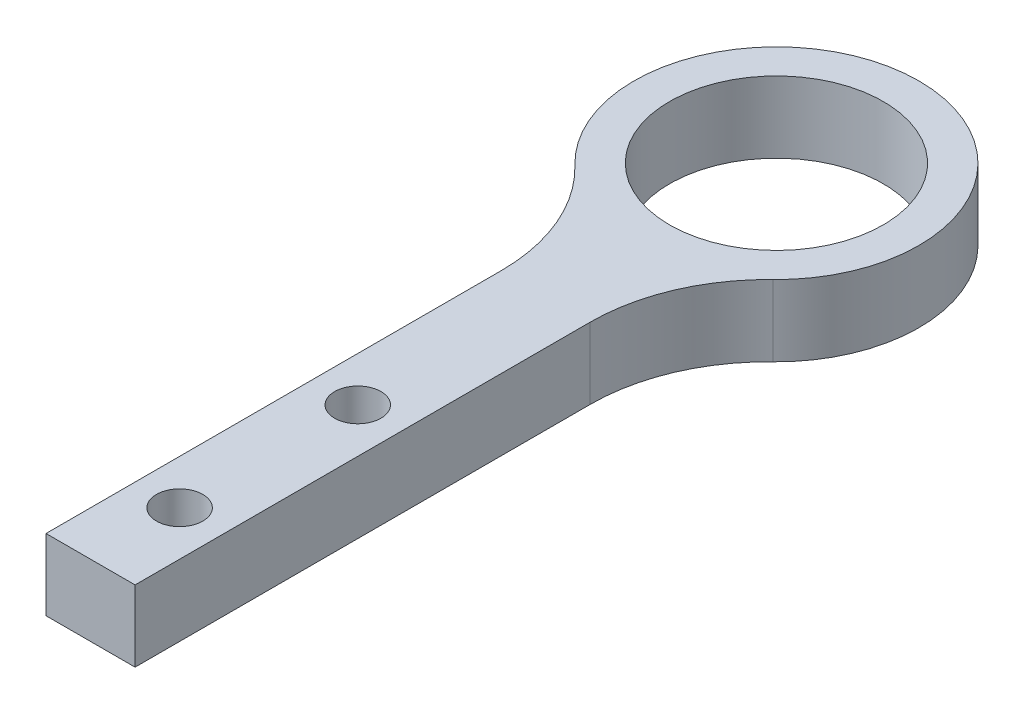
ISO-10303-21;
HEADER;
FILE_DESCRIPTION(('STEP AP214'),'2;1');
FILE_NAME('part.step','',(''),(''),'','','');
FILE_SCHEMA(('AUTOMOTIVE_DESIGN { 1 0 10303 214 1 1 1 1 }'));
ENDSEC;
DATA;
#1=APPLICATION_CONTEXT('core data for automotive mechanical design processes');
#2=APPLICATION_PROTOCOL_DEFINITION('international standard','automotive_design',2000,#1);
#3=PRODUCT_CONTEXT('',#1,'mechanical');
#4=PRODUCT('Part','Part','',(#3));
#5=PRODUCT_RELATED_PRODUCT_CATEGORY('part','',(#4));
#6=PRODUCT_DEFINITION_FORMATION('','',#4);
#7=PRODUCT_DEFINITION_CONTEXT('part definition',#1,'design');
#8=PRODUCT_DEFINITION('design','',#6,#7);
#9=PRODUCT_DEFINITION_SHAPE('','',#8);
#10=(LENGTH_UNIT() NAMED_UNIT(*) SI_UNIT(.MILLI.,.METRE.));
#11=(NAMED_UNIT(*) PLANE_ANGLE_UNIT() SI_UNIT($,.RADIAN.));
#12=(NAMED_UNIT(*) SI_UNIT($,.STERADIAN.) SOLID_ANGLE_UNIT());
#13=UNCERTAINTY_MEASURE_WITH_UNIT(LENGTH_MEASURE(1.E-05),#10,'distance_accuracy_value','');
#14=(GEOMETRIC_REPRESENTATION_CONTEXT(3) GLOBAL_UNCERTAINTY_ASSIGNED_CONTEXT((#13)) GLOBAL_UNIT_ASSIGNED_CONTEXT((#10,
#11,#12)) REPRESENTATION_CONTEXT('',''));
#15=CARTESIAN_POINT('',(0.,0.,0.));
#16=DIRECTION('',(0.,0.,1.));
#17=DIRECTION('',(1.,0.,0.));
#18=AXIS2_PLACEMENT_3D('',#15,#16,#17);
#19=CARTESIAN_POINT('',(-12.5,4.,12.9518338469886));
#20=DIRECTION('',(0.,-1.,0.));
#21=DIRECTION('',(0.,0.,-1.));
#22=AXIS2_PLACEMENT_3D('',#19,#20,#21);
#23=PLANE('',#22);
#24=CARTESIAN_POINT('',(0.,4.,23.5));
#25=DIRECTION('',(0.,-1.,0.));
#26=DIRECTION('',(0.,0.,-1.));
#27=AXIS2_PLACEMENT_3D('',#24,#25,#26);
#28=CIRCLE('',#27,1.3);
#29=CARTESIAN_POINT('',(0.,4.,22.2));
#30=VERTEX_POINT('',#29);
#31=EDGE_CURVE('E191',#30,#30,#28,.T.);
#32=ORIENTED_EDGE('',*,*,#31,.T.);
#33=EDGE_LOOP('',(#32));
#34=FACE_BOUND('',#33,.T.);
#35=CARTESIAN_POINT('',(0.,4.,33.5));
#36=DIRECTION('',(0.,-1.,0.));
#37=DIRECTION('',(0.,0.,-1.));
#38=AXIS2_PLACEMENT_3D('',#35,#36,#37);
#39=CIRCLE('',#38,1.3);
#40=CARTESIAN_POINT('',(0.,4.,32.2));
#41=VERTEX_POINT('',#40);
#42=EDGE_CURVE('E201',#41,#41,#39,.T.);
#43=ORIENTED_EDGE('',*,*,#42,.T.);
#44=EDGE_LOOP('',(#43));
#45=FACE_BOUND('',#44,.T.);
#46=DIRECTION('',(0.,0.,-1.));
#47=VECTOR('',#46,1.);
#48=CARTESIAN_POINT('',(2.5,4.,12.9518338469886));
#49=LINE('',#48,#47);
#50=CARTESIAN_POINT('',(2.5,4.,38.5));
#51=VERTEX_POINT('',#50);
#52=CARTESIAN_POINT('',(2.5,4.,12.9518338469886));
#53=VERTEX_POINT('',#52);
#54=EDGE_CURVE('E130',#51,#53,#49,.T.);
#55=ORIENTED_EDGE('',*,*,#54,.T.);
#56=CARTESIAN_POINT('',(12.5,4.,12.9518338469886));
#57=DIRECTION('',(0.,-1.,0.));
#58=DIRECTION('',(0.,0.,1.));
#59=AXIS2_PLACEMENT_3D('',#56,#57,#58);
#60=CIRCLE('',#59,10.);
#61=CARTESIAN_POINT('',(5.55555555555555,4.,5.75637059866161));
#62=VERTEX_POINT('',#61);
#63=EDGE_CURVE('E88',#53,#62,#60,.T.);
#64=ORIENTED_EDGE('',*,*,#63,.T.);
#65=CARTESIAN_POINT('',(0.,4.,0.));
#66=DIRECTION('',(0.,1.,0.));
#67=DIRECTION('',(0.,0.,1.));
#68=AXIS2_PLACEMENT_3D('',#65,#66,#67);
#69=CIRCLE('',#68,8.);
#70=CARTESIAN_POINT('',(-5.55555555555556,4.,5.75637059866161));
#71=VERTEX_POINT('',#70);
#72=EDGE_CURVE('E101',#62,#71,#69,.T.);
#73=ORIENTED_EDGE('',*,*,#72,.T.);
#74=CARTESIAN_POINT('',(-12.5,4.,12.9518338469886));
#75=DIRECTION('',(0.,-1.,0.));
#76=DIRECTION('',(0.,0.,-1.));
#77=AXIS2_PLACEMENT_3D('',#74,#75,#76);
#78=CIRCLE('',#77,10.);
#79=CARTESIAN_POINT('',(-2.5,4.,12.9518338469886));
#80=VERTEX_POINT('',#79);
#81=EDGE_CURVE('E95',#71,#80,#78,.T.);
#82=ORIENTED_EDGE('',*,*,#81,.T.);
#83=DIRECTION('',(0.,0.,1.));
#84=VECTOR('',#83,1.);
#85=CARTESIAN_POINT('',(-2.5,4.,12.9518338469886));
#86=LINE('',#85,#84);
#87=CARTESIAN_POINT('',(-2.5,4.,38.5));
#88=VERTEX_POINT('',#87);
#89=EDGE_CURVE('E99',#80,#88,#86,.T.);
#90=ORIENTED_EDGE('',*,*,#89,.T.);
#91=DIRECTION('',(1.,0.,0.));
#92=VECTOR('',#91,1.);
#93=CARTESIAN_POINT('',(-2.5,4.,38.5));
#94=LINE('',#93,#92);
#95=EDGE_CURVE('E51',#88,#51,#94,.T.);
#96=ORIENTED_EDGE('',*,*,#95,.T.);
#97=EDGE_LOOP('',(#55,#64,#73,#82,#90,#96));
#98=FACE_BOUND('',#97,.T.);
#99=CARTESIAN_POINT('',(0.,4.,0.));
#100=DIRECTION('',(0.,1.,0.));
#101=DIRECTION('',(0.,0.,1.));
#102=AXIS2_PLACEMENT_3D('',#99,#100,#101);
#103=CIRCLE('',#102,6.);
#104=CARTESIAN_POINT('',(0.,4.,6.));
#105=VERTEX_POINT('',#104);
#106=EDGE_CURVE('E123',#105,#105,#103,.T.);
#107=ORIENTED_EDGE('',*,*,#106,.F.);
#108=EDGE_LOOP('',(#107));
#109=FACE_BOUND('',#108,.T.);
#110=ADVANCED_FACE('F34',(#34,#45,#98,#109),#23,.F.);
#111=CARTESIAN_POINT('',(-12.5,0.,12.9518338469886));
#112=DIRECTION('',(0.,-1.,0.));
#113=DIRECTION('',(0.,0.,-1.));
#114=AXIS2_PLACEMENT_3D('',#111,#112,#113);
#115=PLANE('',#114);
#116=CARTESIAN_POINT('',(0.,0.,23.5));
#117=DIRECTION('',(0.,-1.,0.));
#118=DIRECTION('',(0.,0.,-1.));
#119=AXIS2_PLACEMENT_3D('',#116,#117,#118);
#120=CIRCLE('',#119,2.2);
#121=CARTESIAN_POINT('',(0.,0.,21.3));
#122=VERTEX_POINT('',#121);
#123=EDGE_CURVE('E189',#122,#122,#120,.T.);
#124=ORIENTED_EDGE('',*,*,#123,.F.);
#125=EDGE_LOOP('',(#124));
#126=FACE_BOUND('',#125,.T.);
#127=CARTESIAN_POINT('',(0.,0.,33.5));
#128=DIRECTION('',(0.,-1.,0.));
#129=DIRECTION('',(0.,0.,-1.));
#130=AXIS2_PLACEMENT_3D('',#127,#128,#129);
#131=CIRCLE('',#130,2.2);
#132=CARTESIAN_POINT('',(0.,0.,31.3));
#133=VERTEX_POINT('',#132);
#134=EDGE_CURVE('E195',#133,#133,#131,.T.);
#135=ORIENTED_EDGE('',*,*,#134,.F.);
#136=EDGE_LOOP('',(#135));
#137=FACE_BOUND('',#136,.T.);
#138=DIRECTION('',(0.,0.,-1.));
#139=VECTOR('',#138,1.);
#140=CARTESIAN_POINT('',(2.5,0.,12.9518338469886));
#141=LINE('',#140,#139);
#142=CARTESIAN_POINT('',(2.5,0.,38.5));
#143=VERTEX_POINT('',#142);
#144=CARTESIAN_POINT('',(2.5,0.,12.9518338469886));
#145=VERTEX_POINT('',#144);
#146=EDGE_CURVE('E119',#143,#145,#141,.T.);
#147=ORIENTED_EDGE('',*,*,#146,.F.);
#148=DIRECTION('',(1.,0.,0.));
#149=VECTOR('',#148,1.);
#150=CARTESIAN_POINT('',(-2.5,0.,38.5));
#151=LINE('',#150,#149);
#152=CARTESIAN_POINT('',(-2.5,0.,38.5));
#153=VERTEX_POINT('',#152);
#154=EDGE_CURVE('E80',#153,#143,#151,.T.);
#155=ORIENTED_EDGE('',*,*,#154,.F.);
#156=DIRECTION('',(0.,0.,1.));
#157=VECTOR('',#156,1.);
#158=CARTESIAN_POINT('',(-2.5,0.,12.9518338469886));
#159=LINE('',#158,#157);
#160=CARTESIAN_POINT('',(-2.5,0.,12.9518338469886));
#161=VERTEX_POINT('',#160);
#162=EDGE_CURVE('E74',#161,#153,#159,.T.);
#163=ORIENTED_EDGE('',*,*,#162,.F.);
#164=CARTESIAN_POINT('',(-12.5,0.,12.9518338469886));
#165=DIRECTION('',(0.,-1.,0.));
#166=DIRECTION('',(0.,0.,-1.));
#167=AXIS2_PLACEMENT_3D('',#164,#165,#166);
#168=CIRCLE('',#167,10.);
#169=CARTESIAN_POINT('',(-5.55555555555556,0.,5.75637059866161));
#170=VERTEX_POINT('',#169);
#171=EDGE_CURVE('E109',#170,#161,#168,.T.);
#172=ORIENTED_EDGE('',*,*,#171,.F.);
#173=CARTESIAN_POINT('',(0.,0.,0.));
#174=DIRECTION('',(0.,1.,0.));
#175=DIRECTION('',(0.,0.,1.));
#176=AXIS2_PLACEMENT_3D('',#173,#174,#175);
#177=CIRCLE('',#176,8.);
#178=CARTESIAN_POINT('',(5.55555555555555,0.,5.75637059866161));
#179=VERTEX_POINT('',#178);
#180=EDGE_CURVE('E125',#179,#170,#177,.T.);
#181=ORIENTED_EDGE('',*,*,#180,.F.);
#182=CARTESIAN_POINT('',(12.5,0.,12.9518338469886));
#183=DIRECTION('',(0.,-1.,0.));
#184=DIRECTION('',(0.,0.,1.));
#185=AXIS2_PLACEMENT_3D('',#182,#183,#184);
#186=CIRCLE('',#185,10.);
#187=EDGE_CURVE('E122',#145,#179,#186,.T.);
#188=ORIENTED_EDGE('',*,*,#187,.F.);
#189=EDGE_LOOP('',(#147,#155,#163,#172,#181,#188));
#190=FACE_BOUND('',#189,.T.);
#191=CARTESIAN_POINT('',(0.,0.,0.));
#192=DIRECTION('',(0.,1.,0.));
#193=DIRECTION('',(0.,0.,1.));
#194=AXIS2_PLACEMENT_3D('',#191,#192,#193);
#195=CIRCLE('',#194,6.);
#196=CARTESIAN_POINT('',(0.,0.,6.));
#197=VERTEX_POINT('',#196);
#198=EDGE_CURVE('E204',#197,#197,#195,.T.);
#199=ORIENTED_EDGE('',*,*,#198,.T.);
#200=EDGE_LOOP('',(#199));
#201=FACE_BOUND('',#200,.T.);
#202=ADVANCED_FACE('F139',(#126,#137,#190,#201),#115,.T.);
#203=CARTESIAN_POINT('',(2.5,4.,12.9518338469886));
#204=DIRECTION('',(-1.,0.,0.));
#205=DIRECTION('',(0.,0.,1.));
#206=AXIS2_PLACEMENT_3D('',#203,#204,#205);
#207=PLANE('',#206);
#208=ORIENTED_EDGE('',*,*,#146,.T.);
#209=DIRECTION('',(0.,-1.,0.));
#210=VECTOR('',#209,1.);
#211=CARTESIAN_POINT('',(2.5,4.,12.9518338469886));
#212=LINE('',#211,#210);
#213=EDGE_CURVE('E11',#53,#145,#212,.T.);
#214=ORIENTED_EDGE('',*,*,#213,.F.);
#215=ORIENTED_EDGE('',*,*,#54,.F.);
#216=DIRECTION('',(0.,-1.,0.));
#217=VECTOR('',#216,1.);
#218=CARTESIAN_POINT('',(2.5,4.,38.5));
#219=LINE('',#218,#217);
#220=EDGE_CURVE('E115',#51,#143,#219,.T.);
#221=ORIENTED_EDGE('',*,*,#220,.T.);
#222=EDGE_LOOP('',(#208,#214,#215,#221));
#223=FACE_BOUND('',#222,.T.);
#224=ADVANCED_FACE('F36',(#223),#207,.F.);
#225=CARTESIAN_POINT('',(12.5,4.,12.9518338469886));
#226=DIRECTION('',(0.,-1.,0.));
#227=DIRECTION('',(0.,0.,-1.));
#228=AXIS2_PLACEMENT_3D('',#225,#226,#227);
#229=CYLINDRICAL_SURFACE('',#228,10.);
#230=ORIENTED_EDGE('',*,*,#187,.T.);
#231=DIRECTION('',(0.,-1.,0.));
#232=VECTOR('',#231,1.);
#233=CARTESIAN_POINT('',(5.55555555555555,4.,5.75637059866161));
#234=LINE('',#233,#232);
#235=EDGE_CURVE('E43',#62,#179,#234,.T.);
#236=ORIENTED_EDGE('',*,*,#235,.F.);
#237=ORIENTED_EDGE('',*,*,#63,.F.);
#238=ORIENTED_EDGE('',*,*,#213,.T.);
#239=EDGE_LOOP('',(#230,#236,#237,#238));
#240=FACE_BOUND('',#239,.T.);
#241=ADVANCED_FACE('F259',(#240),#229,.F.);
#242=CARTESIAN_POINT('',(0.,4.,0.));
#243=DIRECTION('',(0.,-1.,0.));
#244=DIRECTION('',(0.,0.,-1.));
#245=AXIS2_PLACEMENT_3D('',#242,#243,#244);
#246=CYLINDRICAL_SURFACE('',#245,8.);
#247=ORIENTED_EDGE('',*,*,#180,.T.);
#248=DIRECTION('',(0.,-1.,0.));
#249=VECTOR('',#248,1.);
#250=CARTESIAN_POINT('',(-5.55555555555556,4.,5.75637059866161));
#251=LINE('',#250,#249);
#252=EDGE_CURVE('E110',#71,#170,#251,.T.);
#253=ORIENTED_EDGE('',*,*,#252,.F.);
#254=ORIENTED_EDGE('',*,*,#72,.F.);
#255=ORIENTED_EDGE('',*,*,#235,.T.);
#256=EDGE_LOOP('',(#247,#253,#254,#255));
#257=FACE_BOUND('',#256,.T.);
#258=ADVANCED_FACE('F136',(#257),#246,.T.);
#259=CARTESIAN_POINT('',(-12.5,4.,12.9518338469886));
#260=DIRECTION('',(0.,-1.,0.));
#261=DIRECTION('',(0.,0.,-1.));
#262=AXIS2_PLACEMENT_3D('',#259,#260,#261);
#263=CYLINDRICAL_SURFACE('',#262,10.);
#264=ORIENTED_EDGE('',*,*,#171,.T.);
#265=DIRECTION('',(0.,-1.,0.));
#266=VECTOR('',#265,1.);
#267=CARTESIAN_POINT('',(-2.5,4.,12.9518338469886));
#268=LINE('',#267,#266);
#269=EDGE_CURVE('E106',#80,#161,#268,.T.);
#270=ORIENTED_EDGE('',*,*,#269,.F.);
#271=ORIENTED_EDGE('',*,*,#81,.F.);
#272=ORIENTED_EDGE('',*,*,#252,.T.);
#273=EDGE_LOOP('',(#264,#270,#271,#272));
#274=FACE_BOUND('',#273,.T.);
#275=ADVANCED_FACE('F107',(#274),#263,.F.);
#276=CARTESIAN_POINT('',(-2.5,4.,12.9518338469886));
#277=DIRECTION('',(1.,0.,0.));
#278=DIRECTION('',(0.,0.,-1.));
#279=AXIS2_PLACEMENT_3D('',#276,#277,#278);
#280=PLANE('',#279);
#281=ORIENTED_EDGE('',*,*,#162,.T.);
#282=DIRECTION('',(0.,-1.,0.));
#283=VECTOR('',#282,1.);
#284=CARTESIAN_POINT('',(-2.5,4.,38.5));
#285=LINE('',#284,#283);
#286=EDGE_CURVE('E111',#88,#153,#285,.T.);
#287=ORIENTED_EDGE('',*,*,#286,.F.);
#288=ORIENTED_EDGE('',*,*,#89,.F.);
#289=ORIENTED_EDGE('',*,*,#269,.T.);
#290=EDGE_LOOP('',(#281,#287,#288,#289));
#291=FACE_BOUND('',#290,.T.);
#292=ADVANCED_FACE('F113',(#291),#280,.F.);
#293=CARTESIAN_POINT('',(-2.5,4.,38.5));
#294=DIRECTION('',(0.,0.,-1.));
#295=DIRECTION('',(-1.,0.,0.));
#296=AXIS2_PLACEMENT_3D('',#293,#294,#295);
#297=PLANE('',#296);
#298=ORIENTED_EDGE('',*,*,#154,.T.);
#299=ORIENTED_EDGE('',*,*,#220,.F.);
#300=ORIENTED_EDGE('',*,*,#95,.F.);
#301=ORIENTED_EDGE('',*,*,#286,.T.);
#302=EDGE_LOOP('',(#298,#299,#300,#301));
#303=FACE_BOUND('',#302,.T.);
#304=ADVANCED_FACE('F144',(#303),#297,.F.);
#305=CARTESIAN_POINT('',(0.,4.,0.));
#306=DIRECTION('',(0.,-1.,0.));
#307=DIRECTION('',(0.,0.,-1.));
#308=AXIS2_PLACEMENT_3D('',#305,#306,#307);
#309=CYLINDRICAL_SURFACE('',#308,6.);
#310=ORIENTED_EDGE('',*,*,#106,.T.);
#311=EDGE_LOOP('',(#310));
#312=FACE_BOUND('',#311,.T.);
#313=ORIENTED_EDGE('',*,*,#198,.F.);
#314=EDGE_LOOP('',(#313));
#315=FACE_BOUND('',#314,.T.);
#316=ADVANCED_FACE('F146',(#312,#315),#309,.F.);
#317=CARTESIAN_POINT('',(0.,0.,33.5));
#318=DIRECTION('',(0.,-1.,0.));
#319=DIRECTION('',(0.,0.,-1.));
#320=AXIS2_PLACEMENT_3D('',#317,#318,#319);
#321=CYLINDRICAL_SURFACE('',#320,1.3);
#322=ORIENTED_EDGE('',*,*,#42,.F.);
#323=EDGE_LOOP('',(#322));
#324=FACE_BOUND('',#323,.T.);
#325=CARTESIAN_POINT('',(0.,0.9,33.5));
#326=DIRECTION('',(0.,-1.,0.));
#327=DIRECTION('',(0.,0.,-1.));
#328=AXIS2_PLACEMENT_3D('',#325,#326,#327);
#329=CIRCLE('',#328,1.3);
#330=CARTESIAN_POINT('',(0.,0.9,32.2));
#331=VERTEX_POINT('',#330);
#332=EDGE_CURVE('E198',#331,#331,#329,.T.);
#333=ORIENTED_EDGE('',*,*,#332,.T.);
#334=EDGE_LOOP('',(#333));
#335=FACE_BOUND('',#334,.T.);
#336=ADVANCED_FACE('F152',(#324,#335),#321,.F.);
#337=CARTESIAN_POINT('',(0.,0.,33.5));
#338=DIRECTION('',(0.,-1.,0.));
#339=DIRECTION('',(0.,0.,-1.));
#340=AXIS2_PLACEMENT_3D('',#337,#338,#339);
#341=CONICAL_SURFACE('',#340,2.2,0.785398163397449);
#342=ORIENTED_EDGE('',*,*,#332,.F.);
#343=EDGE_LOOP('',(#342));
#344=FACE_BOUND('',#343,.T.);
#345=ORIENTED_EDGE('',*,*,#134,.T.);
#346=EDGE_LOOP('',(#345));
#347=FACE_BOUND('',#346,.T.);
#348=ADVANCED_FACE('F169',(#344,#347),#341,.F.);
#349=CARTESIAN_POINT('',(0.,0.,23.5));
#350=DIRECTION('',(0.,-1.,0.));
#351=DIRECTION('',(0.,0.,-1.));
#352=AXIS2_PLACEMENT_3D('',#349,#350,#351);
#353=CYLINDRICAL_SURFACE('',#352,1.3);
#354=ORIENTED_EDGE('',*,*,#31,.F.);
#355=EDGE_LOOP('',(#354));
#356=FACE_BOUND('',#355,.T.);
#357=CARTESIAN_POINT('',(0.,0.9,23.5));
#358=DIRECTION('',(0.,-1.,0.));
#359=DIRECTION('',(0.,0.,-1.));
#360=AXIS2_PLACEMENT_3D('',#357,#358,#359);
#361=CIRCLE('',#360,1.3);
#362=CARTESIAN_POINT('',(0.,0.9,22.2));
#363=VERTEX_POINT('',#362);
#364=EDGE_CURVE('E186',#363,#363,#361,.T.);
#365=ORIENTED_EDGE('',*,*,#364,.T.);
#366=EDGE_LOOP('',(#365));
#367=FACE_BOUND('',#366,.T.);
#368=ADVANCED_FACE('F173',(#356,#367),#353,.F.);
#369=CARTESIAN_POINT('',(0.,0.,23.5));
#370=DIRECTION('',(0.,-1.,0.));
#371=DIRECTION('',(0.,0.,-1.));
#372=AXIS2_PLACEMENT_3D('',#369,#370,#371);
#373=CONICAL_SURFACE('',#372,2.2,0.785398163397449);
#374=ORIENTED_EDGE('',*,*,#364,.F.);
#375=EDGE_LOOP('',(#374));
#376=FACE_BOUND('',#375,.T.);
#377=ORIENTED_EDGE('',*,*,#123,.T.);
#378=EDGE_LOOP('',(#377));
#379=FACE_BOUND('',#378,.T.);
#380=ADVANCED_FACE('F177',(#376,#379),#373,.F.);
#381=CLOSED_SHELL('',(#110,#202,#224,#241,#258,#275,#292,#304,#316,#336,#348,#368,#380));
#382=MANIFOLD_SOLID_BREP('B2',#381);
#383=ADVANCED_BREP_SHAPE_REPRESENTATION('',(#18,#382),#14);
#384=SHAPE_DEFINITION_REPRESENTATION(#9,#383);
ENDSEC;
END-ISO-10303-21;
